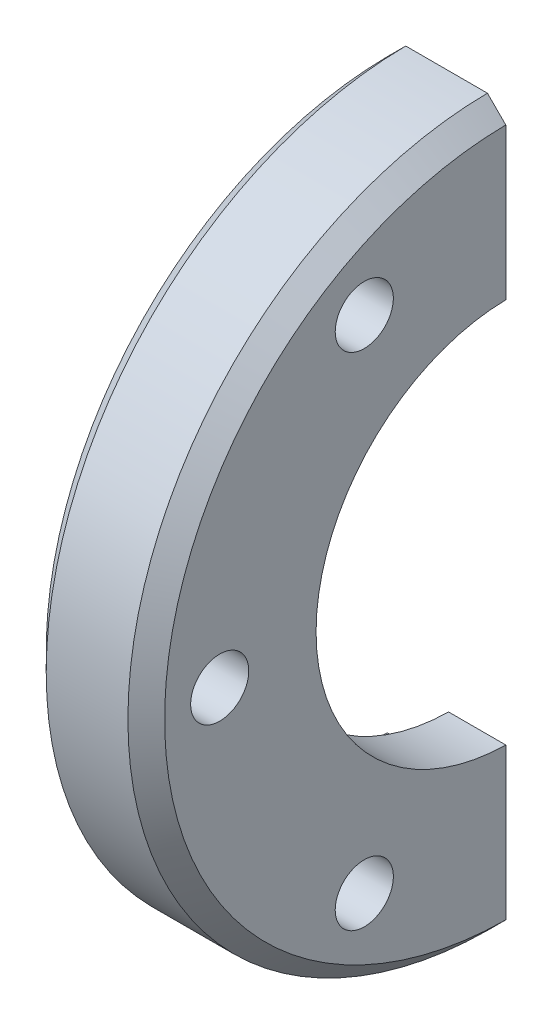
ISO-10303-21;
HEADER;
FILE_DESCRIPTION(('STEP AP214'),'2;1');
FILE_NAME('part.step','',(''),(''),'','','');
FILE_SCHEMA(('AUTOMOTIVE_DESIGN { 1 0 10303 214 1 1 1 1 }'));
ENDSEC;
DATA;
#1=APPLICATION_CONTEXT('core data for automotive mechanical design processes');
#2=APPLICATION_PROTOCOL_DEFINITION('international standard','automotive_design',2000,#1);
#3=PRODUCT_CONTEXT('',#1,'mechanical');
#4=PRODUCT('Part','Part','',(#3));
#5=PRODUCT_RELATED_PRODUCT_CATEGORY('part','',(#4));
#6=PRODUCT_DEFINITION_FORMATION('','',#4);
#7=PRODUCT_DEFINITION_CONTEXT('part definition',#1,'design');
#8=PRODUCT_DEFINITION('design','',#6,#7);
#9=PRODUCT_DEFINITION_SHAPE('','',#8);
#10=(LENGTH_UNIT() NAMED_UNIT(*) SI_UNIT(.MILLI.,.METRE.));
#11=(NAMED_UNIT(*) PLANE_ANGLE_UNIT() SI_UNIT($,.RADIAN.));
#12=(NAMED_UNIT(*) SI_UNIT($,.STERADIAN.) SOLID_ANGLE_UNIT());
#13=UNCERTAINTY_MEASURE_WITH_UNIT(LENGTH_MEASURE(1.E-05),#10,'distance_accuracy_value','');
#14=(GEOMETRIC_REPRESENTATION_CONTEXT(3) GLOBAL_UNCERTAINTY_ASSIGNED_CONTEXT((#13)) GLOBAL_UNIT_ASSIGNED_CONTEXT((#10,
#11,#12)) REPRESENTATION_CONTEXT('',''));
#15=CARTESIAN_POINT('',(0.,0.,0.));
#16=DIRECTION('',(0.,0.,1.));
#17=DIRECTION('',(1.,0.,0.));
#18=AXIS2_PLACEMENT_3D('',#15,#16,#17);
#19=CARTESIAN_POINT('',(0.,20.7872077670379,12.0015));
#20=DIRECTION('',(1.,0.,0.));
#21=DIRECTION('',(0.,0.,1.));
#22=AXIS2_PLACEMENT_3D('',#19,#20,#21);
#23=CYLINDRICAL_SURFACE('',#22,2.413);
#24=CARTESIAN_POINT('',(9.8298,20.7872077670379,12.0015));
#25=DIRECTION('',(-1.,0.,0.));
#26=DIRECTION('',(0.,0.,1.));
#27=AXIS2_PLACEMENT_3D('',#24,#25,#26);
#28=CIRCLE('',#27,2.413);
#29=CARTESIAN_POINT('',(9.8298,20.7872077670379,14.4145));
#30=VERTEX_POINT('',#29);
#31=EDGE_CURVE('E106',#30,#30,#28,.T.);
#32=ORIENTED_EDGE('',*,*,#31,.F.);
#33=EDGE_LOOP('',(#32));
#34=FACE_BOUND('',#33,.T.);
#35=CARTESIAN_POINT('',(0.,20.7872077670379,12.0015));
#36=DIRECTION('',(1.,0.,0.));
#37=DIRECTION('',(0.,0.,1.));
#38=AXIS2_PLACEMENT_3D('',#35,#36,#37);
#39=CIRCLE('',#38,2.413);
#40=CARTESIAN_POINT('',(0.,20.7872077670379,14.4145));
#41=VERTEX_POINT('',#40);
#42=EDGE_CURVE('E128',#41,#41,#39,.T.);
#43=ORIENTED_EDGE('',*,*,#42,.F.);
#44=EDGE_LOOP('',(#43));
#45=FACE_BOUND('',#44,.T.);
#46=ADVANCED_FACE('F16',(#34,#45),#23,.F.);
#47=CARTESIAN_POINT('',(7.4549,0.,0.));
#48=DIRECTION('',(-1.,0.,0.));
#49=DIRECTION('',(0.,-1.,0.));
#50=AXIS2_PLACEMENT_3D('',#47,#48,#49);
#51=CYLINDRICAL_SURFACE('',#50,16.002);
#52=DIRECTION('',(1.,0.,0.));
#53=VECTOR('',#52,1.);
#54=CARTESIAN_POINT('',(7.4549,15.999983999992,0.254));
#55=LINE('',#54,#53);
#56=CARTESIAN_POINT('',(5.08,15.999983999992,0.254));
#57=VERTEX_POINT('',#56);
#58=CARTESIAN_POINT('',(9.8298,15.999983999992,0.254));
#59=VERTEX_POINT('',#58);
#60=EDGE_CURVE('E11',#57,#59,#55,.T.);
#61=ORIENTED_EDGE('',*,*,#60,.T.);
#62=CARTESIAN_POINT('',(9.8298,0.,0.));
#63=DIRECTION('',(-1.,0.,0.));
#64=DIRECTION('',(0.,-1.,0.));
#65=AXIS2_PLACEMENT_3D('',#62,#63,#64);
#66=CIRCLE('',#65,16.002);
#67=CARTESIAN_POINT('',(9.8298,-15.999983999992,0.254));
#68=VERTEX_POINT('',#67);
#69=EDGE_CURVE('E35',#68,#59,#66,.T.);
#70=ORIENTED_EDGE('',*,*,#69,.F.);
#71=DIRECTION('',(-1.,0.,0.));
#72=VECTOR('',#71,1.);
#73=CARTESIAN_POINT('',(7.4549,-15.999983999992,0.254));
#74=LINE('',#73,#72);
#75=CARTESIAN_POINT('',(5.08,-15.999983999992,0.254));
#76=VERTEX_POINT('',#75);
#77=EDGE_CURVE('E26',#68,#76,#74,.T.);
#78=ORIENTED_EDGE('',*,*,#77,.T.);
#79=CARTESIAN_POINT('',(5.08,0.,0.));
#80=DIRECTION('',(-1.,0.,0.));
#81=DIRECTION('',(0.,-1.,0.));
#82=AXIS2_PLACEMENT_3D('',#79,#80,#81);
#83=CIRCLE('',#82,16.002);
#84=EDGE_CURVE('E152',#76,#57,#83,.T.);
#85=ORIENTED_EDGE('',*,*,#84,.T.);
#86=EDGE_LOOP('',(#61,#70,#78,#85));
#87=FACE_BOUND('',#86,.T.);
#88=ADVANCED_FACE('F180',(#87),#51,.F.);
#89=CARTESIAN_POINT('',(0.,0.,0.254));
#90=DIRECTION('',(0.,0.,-1.));
#91=DIRECTION('',(0.,-1.,0.));
#92=AXIS2_PLACEMENT_3D('',#89,#90,#91);
#93=PLANE('',#92);
#94=DIRECTION('',(-1.,0.,0.));
#95=VECTOR('',#94,1.);
#96=CARTESIAN_POINT('',(1.99893019572384,-20.038990302907,0.254));
#97=LINE('',#96,#95);
#98=CARTESIAN_POINT('',(3.99786039144766,-20.038990302907,0.254));
#99=VERTEX_POINT('',#98);
#100=CARTESIAN_POINT('',(0.,-20.038990302907,0.254));
#101=VERTEX_POINT('',#100);
#102=EDGE_CURVE('E159',#99,#101,#97,.T.);
#103=ORIENTED_EDGE('',*,*,#102,.F.);
#104=DIRECTION('',(-0.258794753085111,-0.965932334988128,0.));
#105=VECTOR('',#104,1.);
#106=CARTESIAN_POINT('',(4.53893019572384,-18.0194871514495,0.254));
#107=LINE('',#106,#105);
#108=EDGE_CURVE('E153',#76,#99,#107,.T.);
#109=ORIENTED_EDGE('',*,*,#108,.F.);
#110=ORIENTED_EDGE('',*,*,#77,.F.);
#111=DIRECTION('',(0.,1.,0.));
#112=VECTOR('',#111,1.);
#113=CARTESIAN_POINT('',(9.8298,-11.14425,0.254));
#114=LINE('',#113,#112);
#115=CARTESIAN_POINT('',(9.8298,-28.5738710888113,0.254));
#116=VERTEX_POINT('',#115);
#117=EDGE_CURVE('E88',#116,#68,#114,.T.);
#118=ORIENTED_EDGE('',*,*,#117,.F.);
#119=DIRECTION('',(0.707093520240097,0.707120041884309,0.));
#120=VECTOR('',#119,1.);
#121=CARTESIAN_POINT('',(9.0678,-29.3358996698862,0.254));
#122=LINE('',#121,#120);
#123=CARTESIAN_POINT('',(8.3058,-30.0979282509611,0.254));
#124=VERTEX_POINT('',#123);
#125=EDGE_CURVE('E96',#124,#116,#122,.T.);
#126=ORIENTED_EDGE('',*,*,#125,.F.);
#127=DIRECTION('',(1.,0.,0.));
#128=VECTOR('',#127,1.);
#129=CARTESIAN_POINT('',(4.9149,-30.0979282509611,0.254));
#130=LINE('',#129,#128);
#131=CARTESIAN_POINT('',(1.524,-30.0979282509611,0.254));
#132=VERTEX_POINT('',#131);
#133=EDGE_CURVE('E137',#132,#124,#130,.T.);
#134=ORIENTED_EDGE('',*,*,#133,.F.);
#135=DIRECTION('',(0.707093520240099,-0.707120041884308,0.));
#136=VECTOR('',#135,1.);
#137=CARTESIAN_POINT('',(0.762,-29.3358996698862,0.254));
#138=LINE('',#137,#136);
#139=CARTESIAN_POINT('',(0.,-28.5738710888113,0.254));
#140=VERTEX_POINT('',#139);
#141=EDGE_CURVE('E135',#140,#132,#138,.T.);
#142=ORIENTED_EDGE('',*,*,#141,.F.);
#143=DIRECTION('',(0.,-1.,0.));
#144=VECTOR('',#143,1.);
#145=CARTESIAN_POINT('',(0.,-12.1539,0.254));
#146=LINE('',#145,#144);
#147=EDGE_CURVE('E125',#101,#140,#146,.T.);
#148=ORIENTED_EDGE('',*,*,#147,.F.);
#149=EDGE_LOOP('',(#103,#109,#110,#118,#126,#134,#142,#148));
#150=FACE_BOUND('',#149,.T.);
#151=ADVANCED_FACE('F186',(#150),#93,.T.);
#152=CARTESIAN_POINT('',(4.53893019572384,0.,0.));
#153=DIRECTION('',(-1.,0.,0.));
#154=DIRECTION('',(0.,-1.,0.));
#155=AXIS2_PLACEMENT_3D('',#152,#153,#154);
#156=CONICAL_SURFACE('',#155,18.0213,1.30899693899575);
#157=DIRECTION('',(0.258794753085111,-0.965932334988128,0.));
#158=VECTOR('',#157,1.);
#159=CARTESIAN_POINT('',(4.53893019572384,18.0194871514495,0.254));
#160=LINE('',#159,#158);
#161=CARTESIAN_POINT('',(3.99786039144766,20.038990302907,0.254));
#162=VERTEX_POINT('',#161);
#163=EDGE_CURVE('E149',#162,#57,#160,.T.);
#164=ORIENTED_EDGE('',*,*,#163,.T.);
#165=ORIENTED_EDGE('',*,*,#84,.F.);
#166=ORIENTED_EDGE('',*,*,#108,.T.);
#167=CARTESIAN_POINT('',(3.99786039144766,0.,0.));
#168=DIRECTION('',(-1.,0.,0.));
#169=DIRECTION('',(0.,-1.,0.));
#170=AXIS2_PLACEMENT_3D('',#167,#168,#169);
#171=CIRCLE('',#170,20.0406);
#172=EDGE_CURVE('E154',#99,#162,#171,.T.);
#173=ORIENTED_EDGE('',*,*,#172,.T.);
#174=EDGE_LOOP('',(#164,#165,#166,#173));
#175=FACE_BOUND('',#174,.T.);
#176=ADVANCED_FACE('F194',(#175),#156,.F.);
#177=CARTESIAN_POINT('',(1.99893019572384,0.,0.));
#178=DIRECTION('',(-1.,0.,0.));
#179=DIRECTION('',(0.,-1.,0.));
#180=AXIS2_PLACEMENT_3D('',#177,#178,#179);
#181=CYLINDRICAL_SURFACE('',#180,20.0406);
#182=DIRECTION('',(1.,0.,0.));
#183=VECTOR('',#182,1.);
#184=CARTESIAN_POINT('',(1.99893019572384,20.038990302907,0.254));
#185=LINE('',#184,#183);
#186=CARTESIAN_POINT('',(0.,20.038990302907,0.254));
#187=VERTEX_POINT('',#186);
#188=EDGE_CURVE('E156',#187,#162,#185,.T.);
#189=ORIENTED_EDGE('',*,*,#188,.T.);
#190=ORIENTED_EDGE('',*,*,#172,.F.);
#191=ORIENTED_EDGE('',*,*,#102,.T.);
#192=CARTESIAN_POINT('',(0.,0.,0.));
#193=DIRECTION('',(-1.,0.,0.));
#194=DIRECTION('',(0.,-1.,0.));
#195=AXIS2_PLACEMENT_3D('',#192,#193,#194);
#196=CIRCLE('',#195,20.0406);
#197=EDGE_CURVE('E160',#101,#187,#196,.T.);
#198=ORIENTED_EDGE('',*,*,#197,.T.);
#199=EDGE_LOOP('',(#189,#190,#191,#198));
#200=FACE_BOUND('',#199,.T.);
#201=ADVANCED_FACE('F198',(#200),#181,.F.);
#202=CARTESIAN_POINT('',(0.,-24.3078,0.));
#203=DIRECTION('',(-1.,0.,0.));
#204=DIRECTION('',(0.,0.,1.));
#205=AXIS2_PLACEMENT_3D('',#202,#203,#204);
#206=PLANE('',#205);
#207=DIRECTION('',(0.,-1.,0.));
#208=VECTOR('',#207,1.);
#209=CARTESIAN_POINT('',(0.,-12.1539,0.254));
#210=LINE('',#209,#208);
#211=CARTESIAN_POINT('',(0.,28.5738710888113,0.254));
#212=VERTEX_POINT('',#211);
#213=EDGE_CURVE('E148',#212,#187,#210,.T.);
#214=ORIENTED_EDGE('',*,*,#213,.T.);
#215=ORIENTED_EDGE('',*,*,#197,.F.);
#216=ORIENTED_EDGE('',*,*,#147,.T.);
#217=CARTESIAN_POINT('',(0.,0.,0.));
#218=DIRECTION('',(-1.,0.,0.));
#219=DIRECTION('',(0.,-1.,0.));
#220=AXIS2_PLACEMENT_3D('',#217,#218,#219);
#221=CIRCLE('',#220,28.575);
#222=EDGE_CURVE('E122',#140,#212,#221,.T.);
#223=ORIENTED_EDGE('',*,*,#222,.T.);
#224=EDGE_LOOP('',(#214,#215,#216,#223));
#225=FACE_BOUND('',#224,.T.);
#226=CARTESIAN_POINT('',(0.,-20.7872077670378,12.0015));
#227=DIRECTION('',(1.,0.,0.));
#228=DIRECTION('',(0.,0.,1.));
#229=AXIS2_PLACEMENT_3D('',#226,#227,#228);
#230=CIRCLE('',#229,2.413);
#231=CARTESIAN_POINT('',(0.,-20.7872077670378,14.4145));
#232=VERTEX_POINT('',#231);
#233=EDGE_CURVE('E120',#232,#232,#230,.T.);
#234=ORIENTED_EDGE('',*,*,#233,.T.);
#235=EDGE_LOOP('',(#234));
#236=FACE_BOUND('',#235,.T.);
#237=CARTESIAN_POINT('',(0.,0.,24.003));
#238=DIRECTION('',(1.,0.,0.));
#239=DIRECTION('',(0.,0.,1.));
#240=AXIS2_PLACEMENT_3D('',#237,#238,#239);
#241=CIRCLE('',#240,2.413);
#242=CARTESIAN_POINT('',(0.,0.,26.416));
#243=VERTEX_POINT('',#242);
#244=EDGE_CURVE('E123',#243,#243,#241,.T.);
#245=ORIENTED_EDGE('',*,*,#244,.T.);
#246=EDGE_LOOP('',(#245));
#247=FACE_BOUND('',#246,.T.);
#248=ORIENTED_EDGE('',*,*,#42,.T.);
#249=EDGE_LOOP('',(#248));
#250=FACE_BOUND('',#249,.T.);
#251=ADVANCED_FACE('F165',(#225,#236,#247,#250),#206,.T.);
#252=CARTESIAN_POINT('',(0.,0.,0.254));
#253=DIRECTION('',(0.,0.,-1.));
#254=DIRECTION('',(0.,-1.,0.));
#255=AXIS2_PLACEMENT_3D('',#252,#253,#254);
#256=PLANE('',#255);
#257=ORIENTED_EDGE('',*,*,#188,.F.);
#258=ORIENTED_EDGE('',*,*,#213,.F.);
#259=DIRECTION('',(-0.707093520240099,-0.707120041884308,0.));
#260=VECTOR('',#259,1.);
#261=CARTESIAN_POINT('',(0.762,29.3358996698862,0.254));
#262=LINE('',#261,#260);
#263=CARTESIAN_POINT('',(1.524,30.0979282509611,0.254));
#264=VERTEX_POINT('',#263);
#265=EDGE_CURVE('E132',#264,#212,#262,.T.);
#266=ORIENTED_EDGE('',*,*,#265,.F.);
#267=DIRECTION('',(-1.,0.,0.));
#268=VECTOR('',#267,1.);
#269=CARTESIAN_POINT('',(4.9149,30.0979282509611,0.254));
#270=LINE('',#269,#268);
#271=CARTESIAN_POINT('',(8.3058,30.0979282509611,0.254));
#272=VERTEX_POINT('',#271);
#273=EDGE_CURVE('E93',#272,#264,#270,.T.);
#274=ORIENTED_EDGE('',*,*,#273,.F.);
#275=DIRECTION('',(-0.707093520240097,0.707120041884309,0.));
#276=VECTOR('',#275,1.);
#277=CARTESIAN_POINT('',(9.0678,29.3358996698862,0.254));
#278=LINE('',#277,#276);
#279=CARTESIAN_POINT('',(9.8298,28.5738710888113,0.254));
#280=VERTEX_POINT('',#279);
#281=EDGE_CURVE('E78',#280,#272,#278,.T.);
#282=ORIENTED_EDGE('',*,*,#281,.F.);
#283=DIRECTION('',(0.,1.,0.));
#284=VECTOR('',#283,1.);
#285=CARTESIAN_POINT('',(9.8298,-11.14425,0.254));
#286=LINE('',#285,#284);
#287=EDGE_CURVE('E82',#59,#280,#286,.T.);
#288=ORIENTED_EDGE('',*,*,#287,.F.);
#289=ORIENTED_EDGE('',*,*,#60,.F.);
#290=ORIENTED_EDGE('',*,*,#163,.F.);
#291=EDGE_LOOP('',(#257,#258,#266,#274,#282,#288,#289,#290));
#292=FACE_BOUND('',#291,.T.);
#293=ADVANCED_FACE('F91',(#292),#256,.T.);
#294=CARTESIAN_POINT('',(0.762,0.,0.));
#295=DIRECTION('',(1.,0.,0.));
#296=DIRECTION('',(0.,-1.,0.));
#297=AXIS2_PLACEMENT_3D('',#294,#295,#296);
#298=CONICAL_SURFACE('',#297,29.337,0.785398163397449);
#299=ORIENTED_EDGE('',*,*,#265,.T.);
#300=ORIENTED_EDGE('',*,*,#222,.F.);
#301=ORIENTED_EDGE('',*,*,#141,.T.);
#302=CARTESIAN_POINT('',(1.524,0.,0.));
#303=DIRECTION('',(-1.,0.,0.));
#304=DIRECTION('',(0.,-1.,0.));
#305=AXIS2_PLACEMENT_3D('',#302,#303,#304);
#306=CIRCLE('',#305,30.099);
#307=EDGE_CURVE('E136',#132,#264,#306,.T.);
#308=ORIENTED_EDGE('',*,*,#307,.T.);
#309=EDGE_LOOP('',(#299,#300,#301,#308));
#310=FACE_BOUND('',#309,.T.);
#311=ADVANCED_FACE('F167',(#310),#298,.T.);
#312=CARTESIAN_POINT('',(4.9149,0.,0.));
#313=DIRECTION('',(-1.,0.,0.));
#314=DIRECTION('',(0.,-1.,0.));
#315=AXIS2_PLACEMENT_3D('',#312,#313,#314);
#316=CYLINDRICAL_SURFACE('',#315,30.099);
#317=ORIENTED_EDGE('',*,*,#273,.T.);
#318=ORIENTED_EDGE('',*,*,#307,.F.);
#319=ORIENTED_EDGE('',*,*,#133,.T.);
#320=CARTESIAN_POINT('',(8.3058,0.,0.));
#321=DIRECTION('',(-1.,0.,0.));
#322=DIRECTION('',(0.,-1.,0.));
#323=AXIS2_PLACEMENT_3D('',#320,#321,#322);
#324=CIRCLE('',#323,30.099);
#325=EDGE_CURVE('E95',#124,#272,#324,.T.);
#326=ORIENTED_EDGE('',*,*,#325,.T.);
#327=EDGE_LOOP('',(#317,#318,#319,#326));
#328=FACE_BOUND('',#327,.T.);
#329=ADVANCED_FACE('F169',(#328),#316,.T.);
#330=CARTESIAN_POINT('',(9.0678,0.,0.));
#331=DIRECTION('',(-1.,0.,0.));
#332=DIRECTION('',(0.,-1.,0.));
#333=AXIS2_PLACEMENT_3D('',#330,#331,#332);
#334=CONICAL_SURFACE('',#333,29.337,0.785398163397449);
#335=ORIENTED_EDGE('',*,*,#281,.T.);
#336=ORIENTED_EDGE('',*,*,#325,.F.);
#337=ORIENTED_EDGE('',*,*,#125,.T.);
#338=CARTESIAN_POINT('',(9.8298,0.,0.));
#339=DIRECTION('',(-1.,0.,0.));
#340=DIRECTION('',(0.,-1.,0.));
#341=AXIS2_PLACEMENT_3D('',#338,#339,#340);
#342=CIRCLE('',#341,28.575);
#343=EDGE_CURVE('E85',#116,#280,#342,.T.);
#344=ORIENTED_EDGE('',*,*,#343,.T.);
#345=EDGE_LOOP('',(#335,#336,#337,#344));
#346=FACE_BOUND('',#345,.T.);
#347=ADVANCED_FACE('F99',(#346),#334,.T.);
#348=CARTESIAN_POINT('',(9.8298,-22.2885,0.));
#349=DIRECTION('',(1.,0.,0.));
#350=DIRECTION('',(0.,1.,0.));
#351=AXIS2_PLACEMENT_3D('',#348,#349,#350);
#352=PLANE('',#351);
#353=ORIENTED_EDGE('',*,*,#287,.T.);
#354=ORIENTED_EDGE('',*,*,#343,.F.);
#355=ORIENTED_EDGE('',*,*,#117,.T.);
#356=ORIENTED_EDGE('',*,*,#69,.T.);
#357=EDGE_LOOP('',(#353,#354,#355,#356));
#358=FACE_BOUND('',#357,.T.);
#359=ORIENTED_EDGE('',*,*,#31,.T.);
#360=EDGE_LOOP('',(#359));
#361=FACE_BOUND('',#360,.T.);
#362=CARTESIAN_POINT('',(9.8298,0.,24.003));
#363=DIRECTION('',(-1.,0.,0.));
#364=DIRECTION('',(0.,0.,1.));
#365=AXIS2_PLACEMENT_3D('',#362,#363,#364);
#366=CIRCLE('',#365,2.413);
#367=CARTESIAN_POINT('',(9.8298,0.,26.416));
#368=VERTEX_POINT('',#367);
#369=EDGE_CURVE('E104',#368,#368,#366,.T.);
#370=ORIENTED_EDGE('',*,*,#369,.T.);
#371=EDGE_LOOP('',(#370));
#372=FACE_BOUND('',#371,.T.);
#373=CARTESIAN_POINT('',(9.8298,-20.7872077670378,12.0015));
#374=DIRECTION('',(-1.,0.,0.));
#375=DIRECTION('',(0.,0.,1.));
#376=AXIS2_PLACEMENT_3D('',#373,#374,#375);
#377=CIRCLE('',#376,2.413);
#378=CARTESIAN_POINT('',(9.8298,-20.7872077670378,14.4145));
#379=VERTEX_POINT('',#378);
#380=EDGE_CURVE('E20',#379,#379,#377,.T.);
#381=ORIENTED_EDGE('',*,*,#380,.T.);
#382=EDGE_LOOP('',(#381));
#383=FACE_BOUND('',#382,.T.);
#384=ADVANCED_FACE('F83',(#358,#361,#372,#383),#352,.T.);
#385=CARTESIAN_POINT('',(0.,0.,24.003));
#386=DIRECTION('',(1.,0.,0.));
#387=DIRECTION('',(0.,0.,1.));
#388=AXIS2_PLACEMENT_3D('',#385,#386,#387);
#389=CYLINDRICAL_SURFACE('',#388,2.413);
#390=ORIENTED_EDGE('',*,*,#369,.F.);
#391=EDGE_LOOP('',(#390));
#392=FACE_BOUND('',#391,.T.);
#393=ORIENTED_EDGE('',*,*,#244,.F.);
#394=EDGE_LOOP('',(#393));
#395=FACE_BOUND('',#394,.T.);
#396=ADVANCED_FACE('F117',(#392,#395),#389,.F.);
#397=CARTESIAN_POINT('',(0.,-20.7872077670378,12.0015));
#398=DIRECTION('',(1.,0.,0.));
#399=DIRECTION('',(0.,0.,1.));
#400=AXIS2_PLACEMENT_3D('',#397,#398,#399);
#401=CYLINDRICAL_SURFACE('',#400,2.413);
#402=ORIENTED_EDGE('',*,*,#380,.F.);
#403=EDGE_LOOP('',(#402));
#404=FACE_BOUND('',#403,.T.);
#405=ORIENTED_EDGE('',*,*,#233,.F.);
#406=EDGE_LOOP('',(#405));
#407=FACE_BOUND('',#406,.T.);
#408=ADVANCED_FACE('F18',(#404,#407),#401,.F.);
#409=CLOSED_SHELL('',(#46,#88,#151,#176,#201,#251,#293,#311,#329,#347,#384,#396,#408));
#410=MANIFOLD_SOLID_BREP('B1',#409);
#411=ADVANCED_BREP_SHAPE_REPRESENTATION('',(#18,#410),#14);
#412=SHAPE_DEFINITION_REPRESENTATION(#9,#411);
ENDSEC;
END-ISO-10303-21;
